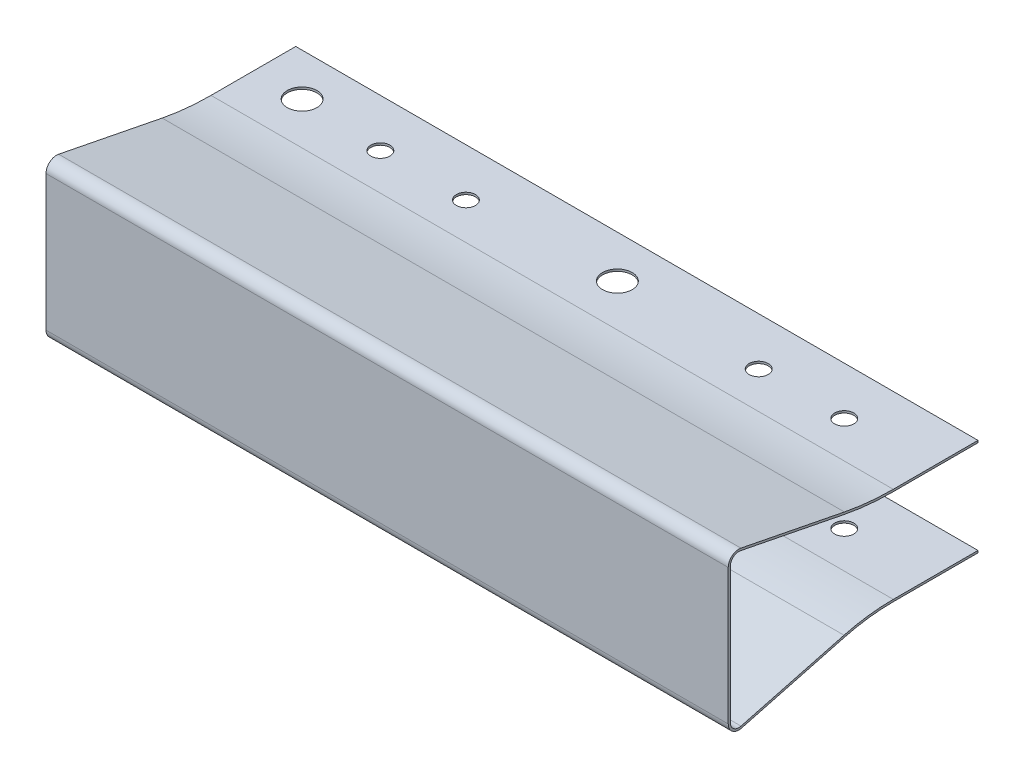
ISO-10303-21;
HEADER;
FILE_DESCRIPTION(('STEP AP214'),'2;1');
FILE_NAME('part.step','',(''),(''),'','','');
FILE_SCHEMA(('AUTOMOTIVE_DESIGN { 1 0 10303 214 1 1 1 1 }'));
ENDSEC;
DATA;
#1=APPLICATION_CONTEXT('core data for automotive mechanical design processes');
#2=APPLICATION_PROTOCOL_DEFINITION('international standard','automotive_design',2000,#1);
#3=PRODUCT_CONTEXT('',#1,'mechanical');
#4=PRODUCT('Part','Part','',(#3));
#5=PRODUCT_RELATED_PRODUCT_CATEGORY('part','',(#4));
#6=PRODUCT_DEFINITION_FORMATION('','',#4);
#7=PRODUCT_DEFINITION_CONTEXT('part definition',#1,'design');
#8=PRODUCT_DEFINITION('design','',#6,#7);
#9=PRODUCT_DEFINITION_SHAPE('','',#8);
#10=(LENGTH_UNIT() NAMED_UNIT(*) SI_UNIT(.MILLI.,.METRE.));
#11=(NAMED_UNIT(*) PLANE_ANGLE_UNIT() SI_UNIT($,.RADIAN.));
#12=(NAMED_UNIT(*) SI_UNIT($,.STERADIAN.) SOLID_ANGLE_UNIT());
#13=UNCERTAINTY_MEASURE_WITH_UNIT(LENGTH_MEASURE(1.E-05),#10,'distance_accuracy_value','');
#14=(GEOMETRIC_REPRESENTATION_CONTEXT(3) GLOBAL_UNCERTAINTY_ASSIGNED_CONTEXT((#13)) GLOBAL_UNIT_ASSIGNED_CONTEXT((#10,
#11,#12)) REPRESENTATION_CONTEXT('',''));
#15=CARTESIAN_POINT('',(0.,0.,0.));
#16=DIRECTION('',(0.,0.,1.));
#17=DIRECTION('',(1.,0.,0.));
#18=AXIS2_PLACEMENT_3D('',#15,#16,#17);
#19=CARTESIAN_POINT('',(40.25,8.,23.22));
#20=DIRECTION('',(-1.,0.,0.));
#21=DIRECTION('',(0.,0.,1.));
#22=AXIS2_PLACEMENT_3D('',#19,#20,#21);
#23=CYLINDRICAL_SURFACE('',#22,1.);
#24=CARTESIAN_POINT('',(-40.25,8.,23.22));
#25=DIRECTION('',(-1.,0.,0.));
#26=DIRECTION('',(0.,0.,-1.));
#27=AXIS2_PLACEMENT_3D('',#24,#25,#26);
#28=CIRCLE('',#27,1.);
#29=CARTESIAN_POINT('',(-40.25,8.,24.22));
#30=VERTEX_POINT('',#29);
#31=CARTESIAN_POINT('',(-40.25,8.98104394957776,23.0262146316233));
#32=VERTEX_POINT('',#31);
#33=EDGE_CURVE('E206',#30,#32,#28,.T.);
#34=ORIENTED_EDGE('',*,*,#33,.T.);
#35=DIRECTION('',(-1.,0.,0.));
#36=VECTOR('',#35,1.);
#37=CARTESIAN_POINT('',(40.25,8.98104394957776,23.0262146316233));
#38=LINE('',#37,#36);
#39=CARTESIAN_POINT('',(40.25,8.98104394957776,23.0262146316233));
#40=VERTEX_POINT('',#39);
#41=EDGE_CURVE('E11',#40,#32,#38,.T.);
#42=ORIENTED_EDGE('',*,*,#41,.F.);
#43=CARTESIAN_POINT('',(40.25,8.,23.22));
#44=DIRECTION('',(-1.,0.,0.));
#45=DIRECTION('',(0.,0.,-1.));
#46=AXIS2_PLACEMENT_3D('',#43,#44,#45);
#47=CIRCLE('',#46,1.);
#48=CARTESIAN_POINT('',(40.25,8.,24.22));
#49=VERTEX_POINT('',#48);
#50=EDGE_CURVE('E245',#49,#40,#47,.T.);
#51=ORIENTED_EDGE('',*,*,#50,.F.);
#52=DIRECTION('',(-1.,0.,0.));
#53=VECTOR('',#52,1.);
#54=CARTESIAN_POINT('',(40.25,8.,24.22));
#55=LINE('',#54,#53);
#56=EDGE_CURVE('E202',#49,#30,#55,.T.);
#57=ORIENTED_EDGE('',*,*,#56,.T.);
#58=EDGE_LOOP('',(#34,#42,#51,#57));
#59=FACE_BOUND('',#58,.T.);
#60=ADVANCED_FACE('F36',(#59),#23,.F.);
#61=CARTESIAN_POINT('',(40.25,6.56868151266737,10.8135610513));
#62=DIRECTION('',(0.,0.981043949577754,-0.193785368376667));
#63=DIRECTION('',(0.,0.193785368376667,0.981043949577755));
#64=AXIS2_PLACEMENT_3D('',#61,#62,#63);
#65=PLANE('',#64);
#66=DIRECTION('',(0.,-0.193785368376667,-0.981043949577754));
#67=VECTOR('',#66,1.);
#68=CARTESIAN_POINT('',(-40.25,6.56868151266737,10.8135610513));
#69=LINE('',#68,#67);
#70=CARTESIAN_POINT('',(-40.25,6.56868151266737,10.8135610513));
#71=VERTEX_POINT('',#70);
#72=EDGE_CURVE('E209',#32,#71,#69,.T.);
#73=ORIENTED_EDGE('',*,*,#72,.T.);
#74=DIRECTION('',(-1.,0.,0.));
#75=VECTOR('',#74,1.);
#76=CARTESIAN_POINT('',(40.25,6.56868151266737,10.8135610513));
#77=LINE('',#76,#75);
#78=CARTESIAN_POINT('',(40.25,6.56868151266737,10.8135610513));
#79=VERTEX_POINT('',#78);
#80=EDGE_CURVE('E45',#79,#71,#77,.T.);
#81=ORIENTED_EDGE('',*,*,#80,.F.);
#82=DIRECTION('',(0.,-0.193785368376667,-0.981043949577754));
#83=VECTOR('',#82,1.);
#84=CARTESIAN_POINT('',(40.25,6.56868151266737,10.8135610513));
#85=LINE('',#84,#83);
#86=EDGE_CURVE('E133',#40,#79,#85,.T.);
#87=ORIENTED_EDGE('',*,*,#86,.F.);
#88=ORIENTED_EDGE('',*,*,#41,.T.);
#89=EDGE_LOOP('',(#73,#81,#87,#88));
#90=FACE_BOUND('',#89,.T.);
#91=ADVANCED_FACE('F420',(#90),#65,.F.);
#92=CARTESIAN_POINT('',(40.25,36.,5.));
#93=DIRECTION('',(-1.,0.,0.));
#94=DIRECTION('',(0.,0.,1.));
#95=AXIS2_PLACEMENT_3D('',#92,#93,#94);
#96=CYLINDRICAL_SURFACE('',#95,30.);
#97=CARTESIAN_POINT('',(-40.25,36.,5.));
#98=DIRECTION('',(1.,0.,0.));
#99=DIRECTION('',(0.,0.,1.));
#100=AXIS2_PLACEMENT_3D('',#97,#98,#99);
#101=CIRCLE('',#100,30.);
#102=CARTESIAN_POINT('',(-40.25,6.,5.));
#103=VERTEX_POINT('',#102);
#104=EDGE_CURVE('E212',#71,#103,#101,.T.);
#105=ORIENTED_EDGE('',*,*,#104,.T.);
#106=DIRECTION('',(-1.,0.,0.));
#107=VECTOR('',#106,1.);
#108=CARTESIAN_POINT('',(40.25,6.,5.));
#109=LINE('',#108,#107);
#110=CARTESIAN_POINT('',(40.25,6.,5.));
#111=VERTEX_POINT('',#110);
#112=EDGE_CURVE('E288',#111,#103,#109,.T.);
#113=ORIENTED_EDGE('',*,*,#112,.F.);
#114=CARTESIAN_POINT('',(40.25,36.,5.));
#115=DIRECTION('',(1.,0.,0.));
#116=DIRECTION('',(0.,0.,1.));
#117=AXIS2_PLACEMENT_3D('',#114,#115,#116);
#118=CIRCLE('',#117,30.);
#119=EDGE_CURVE('E365',#79,#111,#118,.T.);
#120=ORIENTED_EDGE('',*,*,#119,.F.);
#121=ORIENTED_EDGE('',*,*,#80,.T.);
#122=EDGE_LOOP('',(#105,#113,#120,#121));
#123=FACE_BOUND('',#122,.T.);
#124=ADVANCED_FACE('F424',(#123),#96,.T.);
#125=CARTESIAN_POINT('',(40.25,6.,5.));
#126=DIRECTION('',(0.,1.,0.));
#127=DIRECTION('',(0.,0.,1.));
#128=AXIS2_PLACEMENT_3D('',#125,#126,#127);
#129=PLANE('',#128);
#130=CARTESIAN_POINT('',(30.12,6.,0.649999999999999));
#131=DIRECTION('',(0.,1.,0.));
#132=DIRECTION('',(0.,0.,1.));
#133=AXIS2_PLACEMENT_3D('',#130,#131,#132);
#134=CIRCLE('',#133,1.125);
#135=CARTESIAN_POINT('',(30.12,6.,1.775));
#136=VERTEX_POINT('',#135);
#137=EDGE_CURVE('E315',#136,#136,#134,.T.);
#138=ORIENTED_EDGE('',*,*,#137,.T.);
#139=EDGE_LOOP('',(#138));
#140=FACE_BOUND('',#139,.T.);
#141=CARTESIAN_POINT('',(20.02,6.,0.649999999999998));
#142=DIRECTION('',(0.,1.,0.));
#143=DIRECTION('',(0.,0.,1.));
#144=AXIS2_PLACEMENT_3D('',#141,#142,#143);
#145=CIRCLE('',#144,1.125);
#146=CARTESIAN_POINT('',(20.02,6.,1.775));
#147=VERTEX_POINT('',#146);
#148=EDGE_CURVE('E311',#147,#147,#145,.T.);
#149=ORIENTED_EDGE('',*,*,#148,.T.);
#150=EDGE_LOOP('',(#149));
#151=FACE_BOUND('',#150,.T.);
#152=CARTESIAN_POINT('',(2.69999999999999,6.,0.));
#153=DIRECTION('',(0.,1.,0.));
#154=DIRECTION('',(0.,0.,1.));
#155=AXIS2_PLACEMENT_3D('',#152,#153,#154);
#156=CIRCLE('',#155,1.75);
#157=CARTESIAN_POINT('',(2.69999999999999,6.,1.75));
#158=VERTEX_POINT('',#157);
#159=EDGE_CURVE('E307',#158,#158,#156,.T.);
#160=ORIENTED_EDGE('',*,*,#159,.T.);
#161=EDGE_LOOP('',(#160));
#162=FACE_BOUND('',#161,.T.);
#163=CARTESIAN_POINT('',(-14.52,6.,0.649999999999999));
#164=DIRECTION('',(0.,1.,0.));
#165=DIRECTION('',(0.,0.,1.));
#166=AXIS2_PLACEMENT_3D('',#163,#164,#165);
#167=CIRCLE('',#166,1.125);
#168=CARTESIAN_POINT('',(-14.52,6.,1.775));
#169=VERTEX_POINT('',#168);
#170=EDGE_CURVE('E302',#169,#169,#167,.T.);
#171=ORIENTED_EDGE('',*,*,#170,.T.);
#172=EDGE_LOOP('',(#171));
#173=FACE_BOUND('',#172,.T.);
#174=CARTESIAN_POINT('',(-24.62,6.,0.649999999999998));
#175=DIRECTION('',(0.,1.,0.));
#176=DIRECTION('',(0.,0.,1.));
#177=AXIS2_PLACEMENT_3D('',#174,#175,#176);
#178=CIRCLE('',#177,1.125);
#179=CARTESIAN_POINT('',(-24.62,6.,1.775));
#180=VERTEX_POINT('',#179);
#181=EDGE_CURVE('E297',#180,#180,#178,.T.);
#182=ORIENTED_EDGE('',*,*,#181,.T.);
#183=EDGE_LOOP('',(#182));
#184=FACE_BOUND('',#183,.T.);
#185=CARTESIAN_POINT('',(-34.5,6.,0.));
#186=DIRECTION('',(0.,1.,0.));
#187=DIRECTION('',(0.,0.,1.));
#188=AXIS2_PLACEMENT_3D('',#185,#186,#187);
#189=CIRCLE('',#188,1.75);
#190=CARTESIAN_POINT('',(-34.5,6.,1.75));
#191=VERTEX_POINT('',#190);
#192=EDGE_CURVE('E210',#191,#191,#189,.T.);
#193=ORIENTED_EDGE('',*,*,#192,.T.);
#194=EDGE_LOOP('',(#193));
#195=FACE_BOUND('',#194,.T.);
#196=DIRECTION('',(0.,0.,-1.));
#197=VECTOR('',#196,1.);
#198=CARTESIAN_POINT('',(-40.25,6.,5.));
#199=LINE('',#198,#197);
#200=CARTESIAN_POINT('',(-40.25,6.,-5.));
#201=VERTEX_POINT('',#200);
#202=EDGE_CURVE('E214',#103,#201,#199,.T.);
#203=ORIENTED_EDGE('',*,*,#202,.T.);
#204=DIRECTION('',(-1.,0.,0.));
#205=VECTOR('',#204,1.);
#206=CARTESIAN_POINT('',(40.25,6.,-5.));
#207=LINE('',#206,#205);
#208=CARTESIAN_POINT('',(40.25,6.,-5.));
#209=VERTEX_POINT('',#208);
#210=EDGE_CURVE('E285',#209,#201,#207,.T.);
#211=ORIENTED_EDGE('',*,*,#210,.F.);
#212=DIRECTION('',(0.,0.,-1.));
#213=VECTOR('',#212,1.);
#214=CARTESIAN_POINT('',(40.25,6.,5.));
#215=LINE('',#214,#213);
#216=EDGE_CURVE('E367',#111,#209,#215,.T.);
#217=ORIENTED_EDGE('',*,*,#216,.F.);
#218=ORIENTED_EDGE('',*,*,#112,.T.);
#219=EDGE_LOOP('',(#203,#211,#217,#218));
#220=FACE_BOUND('',#219,.T.);
#221=ADVANCED_FACE('F428',(#140,#151,#162,#173,#184,#195,#220),#129,.F.);
#222=CARTESIAN_POINT('',(40.25,6.25,-5.));
#223=DIRECTION('',(0.,0.,1.));
#224=DIRECTION('',(1.,0.,0.));
#225=AXIS2_PLACEMENT_3D('',#222,#223,#224);
#226=PLANE('',#225);
#227=DIRECTION('',(0.,1.,0.));
#228=VECTOR('',#227,1.);
#229=CARTESIAN_POINT('',(-40.25,6.25,-5.));
#230=LINE('',#229,#228);
#231=CARTESIAN_POINT('',(-40.25,6.25,-5.));
#232=VERTEX_POINT('',#231);
#233=EDGE_CURVE('E216',#201,#232,#230,.T.);
#234=ORIENTED_EDGE('',*,*,#233,.T.);
#235=DIRECTION('',(-1.,0.,0.));
#236=VECTOR('',#235,1.);
#237=CARTESIAN_POINT('',(40.25,6.25,-5.));
#238=LINE('',#237,#236);
#239=CARTESIAN_POINT('',(40.25,6.25,-5.));
#240=VERTEX_POINT('',#239);
#241=EDGE_CURVE('E282',#240,#232,#238,.T.);
#242=ORIENTED_EDGE('',*,*,#241,.F.);
#243=DIRECTION('',(0.,1.,0.));
#244=VECTOR('',#243,1.);
#245=CARTESIAN_POINT('',(40.25,6.25,-5.));
#246=LINE('',#245,#244);
#247=EDGE_CURVE('E369',#209,#240,#246,.T.);
#248=ORIENTED_EDGE('',*,*,#247,.F.);
#249=ORIENTED_EDGE('',*,*,#210,.T.);
#250=EDGE_LOOP('',(#234,#242,#248,#249));
#251=FACE_BOUND('',#250,.T.);
#252=ADVANCED_FACE('F434',(#251),#226,.F.);
#253=CARTESIAN_POINT('',(40.25,6.25,5.));
#254=DIRECTION('',(0.,-1.,0.));
#255=DIRECTION('',(0.,0.,-1.));
#256=AXIS2_PLACEMENT_3D('',#253,#254,#255);
#257=PLANE('',#256);
#258=CARTESIAN_POINT('',(30.12,6.25,0.649999999999999));
#259=DIRECTION('',(0.,-1.,0.));
#260=DIRECTION('',(0.,0.,-1.));
#261=AXIS2_PLACEMENT_3D('',#258,#259,#260);
#262=CIRCLE('',#261,1.125);
#263=CARTESIAN_POINT('',(30.12,6.25,-0.475000000000003));
#264=VERTEX_POINT('',#263);
#265=EDGE_CURVE('E322',#264,#264,#262,.T.);
#266=ORIENTED_EDGE('',*,*,#265,.T.);
#267=EDGE_LOOP('',(#266));
#268=FACE_BOUND('',#267,.T.);
#269=CARTESIAN_POINT('',(20.02,6.25,0.649999999999998));
#270=DIRECTION('',(0.,-1.,0.));
#271=DIRECTION('',(0.,0.,-1.));
#272=AXIS2_PLACEMENT_3D('',#269,#270,#271);
#273=CIRCLE('',#272,1.125);
#274=CARTESIAN_POINT('',(20.02,6.25,-0.475000000000003));
#275=VERTEX_POINT('',#274);
#276=EDGE_CURVE('E319',#275,#275,#273,.T.);
#277=ORIENTED_EDGE('',*,*,#276,.T.);
#278=EDGE_LOOP('',(#277));
#279=FACE_BOUND('',#278,.T.);
#280=CARTESIAN_POINT('',(2.69999999999999,6.25,0.));
#281=DIRECTION('',(0.,-1.,0.));
#282=DIRECTION('',(0.,0.,-1.));
#283=AXIS2_PLACEMENT_3D('',#280,#281,#282);
#284=CIRCLE('',#283,1.75);
#285=CARTESIAN_POINT('',(2.69999999999999,6.25,-1.75));
#286=VERTEX_POINT('',#285);
#287=EDGE_CURVE('E337',#286,#286,#284,.T.);
#288=ORIENTED_EDGE('',*,*,#287,.T.);
#289=EDGE_LOOP('',(#288));
#290=FACE_BOUND('',#289,.T.);
#291=CARTESIAN_POINT('',(-14.52,6.25,0.649999999999999));
#292=DIRECTION('',(0.,-1.,0.));
#293=DIRECTION('',(0.,0.,-1.));
#294=AXIS2_PLACEMENT_3D('',#291,#292,#293);
#295=CIRCLE('',#294,1.125);
#296=CARTESIAN_POINT('',(-14.52,6.25,-0.475000000000003));
#297=VERTEX_POINT('',#296);
#298=EDGE_CURVE('E344',#297,#297,#295,.T.);
#299=ORIENTED_EDGE('',*,*,#298,.T.);
#300=EDGE_LOOP('',(#299));
#301=FACE_BOUND('',#300,.T.);
#302=CARTESIAN_POINT('',(-24.62,6.25,0.649999999999998));
#303=DIRECTION('',(0.,-1.,0.));
#304=DIRECTION('',(0.,0.,-1.));
#305=AXIS2_PLACEMENT_3D('',#302,#303,#304);
#306=CIRCLE('',#305,1.125);
#307=CARTESIAN_POINT('',(-24.62,6.25,-0.475000000000003));
#308=VERTEX_POINT('',#307);
#309=EDGE_CURVE('E351',#308,#308,#306,.T.);
#310=ORIENTED_EDGE('',*,*,#309,.T.);
#311=EDGE_LOOP('',(#310));
#312=FACE_BOUND('',#311,.T.);
#313=CARTESIAN_POINT('',(-34.5,6.25,0.));
#314=DIRECTION('',(0.,-1.,0.));
#315=DIRECTION('',(0.,0.,-1.));
#316=AXIS2_PLACEMENT_3D('',#313,#314,#315);
#317=CIRCLE('',#316,1.75);
#318=CARTESIAN_POINT('',(-34.5,6.25,-1.75));
#319=VERTEX_POINT('',#318);
#320=EDGE_CURVE('E358',#319,#319,#317,.T.);
#321=ORIENTED_EDGE('',*,*,#320,.T.);
#322=EDGE_LOOP('',(#321));
#323=FACE_BOUND('',#322,.T.);
#324=DIRECTION('',(0.,0.,1.));
#325=VECTOR('',#324,1.);
#326=CARTESIAN_POINT('',(-40.25,6.25,5.));
#327=LINE('',#326,#325);
#328=CARTESIAN_POINT('',(-40.25,6.25,4.99999999999999));
#329=VERTEX_POINT('',#328);
#330=EDGE_CURVE('E218',#232,#329,#327,.T.);
#331=ORIENTED_EDGE('',*,*,#330,.T.);
#332=DIRECTION('',(-1.,0.,0.));
#333=VECTOR('',#332,1.);
#334=CARTESIAN_POINT('',(40.25,6.25,4.99999999999999));
#335=LINE('',#334,#333);
#336=CARTESIAN_POINT('',(40.25,6.25,4.99999999999999));
#337=VERTEX_POINT('',#336);
#338=EDGE_CURVE('E279',#337,#329,#335,.T.);
#339=ORIENTED_EDGE('',*,*,#338,.F.);
#340=DIRECTION('',(0.,0.,1.));
#341=VECTOR('',#340,1.);
#342=CARTESIAN_POINT('',(40.25,6.25,5.));
#343=LINE('',#342,#341);
#344=EDGE_CURVE('E371',#240,#337,#343,.T.);
#345=ORIENTED_EDGE('',*,*,#344,.F.);
#346=ORIENTED_EDGE('',*,*,#241,.T.);
#347=EDGE_LOOP('',(#331,#339,#345,#346));
#348=FACE_BOUND('',#347,.T.);
#349=ADVANCED_FACE('F437',(#268,#279,#290,#301,#312,#323,#348),#257,.F.);
#350=CARTESIAN_POINT('',(40.25,36.,5.));
#351=DIRECTION('',(-1.,0.,0.));
#352=DIRECTION('',(0.,0.,1.));
#353=AXIS2_PLACEMENT_3D('',#350,#351,#352);
#354=CYLINDRICAL_SURFACE('',#353,29.75);
#355=CARTESIAN_POINT('',(-40.25,36.,5.));
#356=DIRECTION('',(-1.,0.,0.));
#357=DIRECTION('',(0.,0.,1.));
#358=AXIS2_PLACEMENT_3D('',#355,#356,#357);
#359=CIRCLE('',#358,29.75);
#360=CARTESIAN_POINT('',(-40.25,6.81394250006181,10.7651147092058));
#361=VERTEX_POINT('',#360);
#362=EDGE_CURVE('E220',#329,#361,#359,.T.);
#363=ORIENTED_EDGE('',*,*,#362,.T.);
#364=DIRECTION('',(-1.,0.,0.));
#365=VECTOR('',#364,1.);
#366=CARTESIAN_POINT('',(40.25,6.81394250006181,10.7651147092058));
#367=LINE('',#366,#365);
#368=CARTESIAN_POINT('',(40.25,6.81394250006181,10.7651147092058));
#369=VERTEX_POINT('',#368);
#370=EDGE_CURVE('E276',#369,#361,#367,.T.);
#371=ORIENTED_EDGE('',*,*,#370,.F.);
#372=CARTESIAN_POINT('',(40.25,36.,5.));
#373=DIRECTION('',(-1.,0.,0.));
#374=DIRECTION('',(0.,0.,1.));
#375=AXIS2_PLACEMENT_3D('',#372,#373,#374);
#376=CIRCLE('',#375,29.75);
#377=EDGE_CURVE('E373',#337,#369,#376,.T.);
#378=ORIENTED_EDGE('',*,*,#377,.F.);
#379=ORIENTED_EDGE('',*,*,#338,.T.);
#380=EDGE_LOOP('',(#363,#371,#378,#379));
#381=FACE_BOUND('',#380,.T.);
#382=ADVANCED_FACE('F441',(#381),#354,.F.);
#383=CARTESIAN_POINT('',(40.25,6.81394250006181,10.7651147092058));
#384=DIRECTION('',(0.,-0.981043949577754,0.193785368376667));
#385=DIRECTION('',(0.,-0.193785368376668,-0.981043949577754));
#386=AXIS2_PLACEMENT_3D('',#383,#384,#385);
#387=PLANE('',#386);
#388=DIRECTION('',(0.,0.193785368376668,0.981043949577754));
#389=VECTOR('',#388,1.);
#390=CARTESIAN_POINT('',(-40.25,6.81394250006181,10.7651147092058));
#391=LINE('',#390,#389);
#392=CARTESIAN_POINT('',(-40.25,9.22630493697219,22.9777682895292));
#393=VERTEX_POINT('',#392);
#394=EDGE_CURVE('E222',#361,#393,#391,.T.);
#395=ORIENTED_EDGE('',*,*,#394,.T.);
#396=DIRECTION('',(-1.,0.,0.));
#397=VECTOR('',#396,1.);
#398=CARTESIAN_POINT('',(40.25,9.22630493697219,22.9777682895292));
#399=LINE('',#398,#397);
#400=CARTESIAN_POINT('',(40.25,9.22630493697219,22.9777682895292));
#401=VERTEX_POINT('',#400);
#402=EDGE_CURVE('E273',#401,#393,#399,.T.);
#403=ORIENTED_EDGE('',*,*,#402,.F.);
#404=DIRECTION('',(0.,0.193785368376668,0.981043949577754));
#405=VECTOR('',#404,1.);
#406=CARTESIAN_POINT('',(40.25,6.81394250006181,10.7651147092058));
#407=LINE('',#406,#405);
#408=EDGE_CURVE('E375',#369,#401,#407,.T.);
#409=ORIENTED_EDGE('',*,*,#408,.F.);
#410=ORIENTED_EDGE('',*,*,#370,.T.);
#411=EDGE_LOOP('',(#395,#403,#409,#410));
#412=FACE_BOUND('',#411,.T.);
#413=ADVANCED_FACE('F445',(#412),#387,.F.);
#414=CARTESIAN_POINT('',(40.25,8.,23.22));
#415=DIRECTION('',(-1.,0.,0.));
#416=DIRECTION('',(0.,0.,1.));
#417=AXIS2_PLACEMENT_3D('',#414,#415,#416);
#418=CYLINDRICAL_SURFACE('',#417,1.25);
#419=CARTESIAN_POINT('',(-40.25,8.,23.22));
#420=DIRECTION('',(1.,0.,0.));
#421=DIRECTION('',(0.,0.,-1.));
#422=AXIS2_PLACEMENT_3D('',#419,#420,#421);
#423=CIRCLE('',#422,1.25);
#424=CARTESIAN_POINT('',(-40.25,8.,24.47));
#425=VERTEX_POINT('',#424);
#426=EDGE_CURVE('E224',#393,#425,#423,.T.);
#427=ORIENTED_EDGE('',*,*,#426,.T.);
#428=DIRECTION('',(-1.,0.,0.));
#429=VECTOR('',#428,1.);
#430=CARTESIAN_POINT('',(40.25,8.,24.47));
#431=LINE('',#430,#429);
#432=CARTESIAN_POINT('',(40.25,8.,24.47));
#433=VERTEX_POINT('',#432);
#434=EDGE_CURVE('E270',#433,#425,#431,.T.);
#435=ORIENTED_EDGE('',*,*,#434,.F.);
#436=CARTESIAN_POINT('',(40.25,8.,23.22));
#437=DIRECTION('',(1.,0.,0.));
#438=DIRECTION('',(0.,0.,-1.));
#439=AXIS2_PLACEMENT_3D('',#436,#437,#438);
#440=CIRCLE('',#439,1.25);
#441=EDGE_CURVE('E377',#401,#433,#440,.T.);
#442=ORIENTED_EDGE('',*,*,#441,.F.);
#443=ORIENTED_EDGE('',*,*,#402,.T.);
#444=EDGE_LOOP('',(#427,#435,#442,#443));
#445=FACE_BOUND('',#444,.T.);
#446=ADVANCED_FACE('F449',(#445),#418,.T.);
#447=CARTESIAN_POINT('',(40.25,8.,24.47));
#448=DIRECTION('',(0.,0.,-1.));
#449=DIRECTION('',(-1.,0.,0.));
#450=AXIS2_PLACEMENT_3D('',#447,#448,#449);
#451=PLANE('',#450);
#452=DIRECTION('',(0.,-1.,0.));
#453=VECTOR('',#452,1.);
#454=CARTESIAN_POINT('',(-40.25,8.,24.47));
#455=LINE('',#454,#453);
#456=CARTESIAN_POINT('',(-40.25,-8.,24.47));
#457=VERTEX_POINT('',#456);
#458=EDGE_CURVE('E226',#425,#457,#455,.T.);
#459=ORIENTED_EDGE('',*,*,#458,.T.);
#460=DIRECTION('',(-1.,0.,0.));
#461=VECTOR('',#460,1.);
#462=CARTESIAN_POINT('',(40.25,-8.,24.47));
#463=LINE('',#462,#461);
#464=CARTESIAN_POINT('',(40.25,-8.,24.47));
#465=VERTEX_POINT('',#464);
#466=EDGE_CURVE('E267',#465,#457,#463,.T.);
#467=ORIENTED_EDGE('',*,*,#466,.F.);
#468=DIRECTION('',(0.,-1.,0.));
#469=VECTOR('',#468,1.);
#470=CARTESIAN_POINT('',(40.25,8.,24.47));
#471=LINE('',#470,#469);
#472=EDGE_CURVE('E379',#433,#465,#471,.T.);
#473=ORIENTED_EDGE('',*,*,#472,.F.);
#474=ORIENTED_EDGE('',*,*,#434,.T.);
#475=EDGE_LOOP('',(#459,#467,#473,#474));
#476=FACE_BOUND('',#475,.T.);
#477=ADVANCED_FACE('F453',(#476),#451,.F.);
#478=CARTESIAN_POINT('',(40.25,-8.,23.22));
#479=DIRECTION('',(-1.,0.,0.));
#480=DIRECTION('',(0.,0.,1.));
#481=AXIS2_PLACEMENT_3D('',#478,#479,#480);
#482=CYLINDRICAL_SURFACE('',#481,1.25);
#483=CARTESIAN_POINT('',(-40.25,-8.,23.22));
#484=DIRECTION('',(1.,0.,0.));
#485=DIRECTION('',(0.,0.,-1.));
#486=AXIS2_PLACEMENT_3D('',#483,#484,#485);
#487=CIRCLE('',#486,1.25);
#488=CARTESIAN_POINT('',(-40.25,-9.20850235944556,22.9005910971583));
#489=VERTEX_POINT('',#488);
#490=EDGE_CURVE('E228',#457,#489,#487,.T.);
#491=ORIENTED_EDGE('',*,*,#490,.T.);
#492=DIRECTION('',(-1.,0.,0.));
#493=VECTOR('',#492,1.);
#494=CARTESIAN_POINT('',(40.25,-9.20850235944556,22.9005910971583));
#495=LINE('',#494,#493);
#496=CARTESIAN_POINT('',(40.25,-9.20850235944556,22.9005910971583));
#497=VERTEX_POINT('',#496);
#498=EDGE_CURVE('E264',#497,#489,#495,.T.);
#499=ORIENTED_EDGE('',*,*,#498,.F.);
#500=CARTESIAN_POINT('',(40.25,-8.,23.22));
#501=DIRECTION('',(1.,0.,0.));
#502=DIRECTION('',(0.,0.,-1.));
#503=AXIS2_PLACEMENT_3D('',#500,#501,#502);
#504=CIRCLE('',#503,1.25);
#505=EDGE_CURVE('E381',#465,#497,#504,.T.);
#506=ORIENTED_EDGE('',*,*,#505,.F.);
#507=ORIENTED_EDGE('',*,*,#466,.T.);
#508=EDGE_LOOP('',(#491,#499,#506,#507));
#509=FACE_BOUND('',#508,.T.);
#510=ADVANCED_FACE('F457',(#509),#482,.T.);
#511=CARTESIAN_POINT('',(40.25,-5.99699897703984,10.7496792707317));
#512=DIRECTION('',(0.,0.966801887556448,0.25552712227333));
#513=DIRECTION('',(0.,-0.25552712227333,0.966801887556448));
#514=AXIS2_PLACEMENT_3D('',#511,#512,#513);
#515=PLANE('',#514);
#516=DIRECTION('',(0.,0.255527122273329,-0.966801887556448));
#517=VECTOR('',#516,1.);
#518=CARTESIAN_POINT('',(-40.25,-5.99699897703984,10.7496792707317));
#519=LINE('',#518,#517);
#520=CARTESIAN_POINT('',(-40.25,-5.99699897703983,10.7496792707317));
#521=VERTEX_POINT('',#520);
#522=EDGE_CURVE('E230',#489,#521,#519,.T.);
#523=ORIENTED_EDGE('',*,*,#522,.T.);
#524=DIRECTION('',(-1.,0.,0.));
#525=VECTOR('',#524,1.);
#526=CARTESIAN_POINT('',(40.25,-5.99699897703983,10.7496792707317));
#527=LINE('',#526,#525);
#528=CARTESIAN_POINT('',(40.25,-5.99699897703983,10.7496792707317));
#529=VERTEX_POINT('',#528);
#530=EDGE_CURVE('E261',#529,#521,#527,.T.);
#531=ORIENTED_EDGE('',*,*,#530,.F.);
#532=DIRECTION('',(0.,0.255527122273329,-0.966801887556448));
#533=VECTOR('',#532,1.);
#534=CARTESIAN_POINT('',(40.25,-5.99699897703984,10.7496792707317));
#535=LINE('',#534,#533);
#536=EDGE_CURVE('E383',#497,#529,#535,.T.);
#537=ORIENTED_EDGE('',*,*,#536,.F.);
#538=ORIENTED_EDGE('',*,*,#498,.T.);
#539=EDGE_LOOP('',(#523,#531,#537,#538));
#540=FACE_BOUND('',#539,.T.);
#541=ADVANCED_FACE('F461',(#540),#515,.F.);
#542=CARTESIAN_POINT('',(40.25,-27.7512484764001,5.));
#543=DIRECTION('',(-1.,0.,0.));
#544=DIRECTION('',(0.,0.,1.));
#545=AXIS2_PLACEMENT_3D('',#542,#543,#544);
#546=CYLINDRICAL_SURFACE('',#545,22.5012484764001);
#547=CARTESIAN_POINT('',(-40.25,-27.7512484764001,5.));
#548=DIRECTION('',(-1.,0.,0.));
#549=DIRECTION('',(0.,0.,-1.));
#550=AXIS2_PLACEMENT_3D('',#547,#548,#549);
#551=CIRCLE('',#550,22.5012484764001);
#552=CARTESIAN_POINT('',(-40.25,-5.25,5.));
#553=VERTEX_POINT('',#552);
#554=EDGE_CURVE('E232',#521,#553,#551,.T.);
#555=ORIENTED_EDGE('',*,*,#554,.T.);
#556=DIRECTION('',(-1.,0.,0.));
#557=VECTOR('',#556,1.);
#558=CARTESIAN_POINT('',(40.25,-5.25,5.));
#559=LINE('',#558,#557);
#560=CARTESIAN_POINT('',(40.25,-5.25,5.));
#561=VERTEX_POINT('',#560);
#562=EDGE_CURVE('E258',#561,#553,#559,.T.);
#563=ORIENTED_EDGE('',*,*,#562,.F.);
#564=CARTESIAN_POINT('',(40.25,-27.7512484764001,5.));
#565=DIRECTION('',(-1.,0.,0.));
#566=DIRECTION('',(0.,0.,-1.));
#567=AXIS2_PLACEMENT_3D('',#564,#565,#566);
#568=CIRCLE('',#567,22.5012484764001);
#569=EDGE_CURVE('E385',#529,#561,#568,.T.);
#570=ORIENTED_EDGE('',*,*,#569,.F.);
#571=ORIENTED_EDGE('',*,*,#530,.T.);
#572=EDGE_LOOP('',(#555,#563,#570,#571));
#573=FACE_BOUND('',#572,.T.);
#574=ADVANCED_FACE('F465',(#573),#546,.F.);
#575=CARTESIAN_POINT('',(40.25,-5.25,5.));
#576=DIRECTION('',(0.,1.,0.));
#577=DIRECTION('',(0.,0.,1.));
#578=AXIS2_PLACEMENT_3D('',#575,#576,#577);
#579=PLANE('',#578);
#580=CARTESIAN_POINT('',(30.12,-5.25,0.649999999999999));
#581=DIRECTION('',(0.,1.,0.));
#582=DIRECTION('',(0.,0.,1.));
#583=AXIS2_PLACEMENT_3D('',#580,#581,#582);
#584=CIRCLE('',#583,1.125);
#585=CARTESIAN_POINT('',(30.12,-5.25,1.775));
#586=VERTEX_POINT('',#585);
#587=EDGE_CURVE('E327',#586,#586,#584,.T.);
#588=ORIENTED_EDGE('',*,*,#587,.T.);
#589=EDGE_LOOP('',(#588));
#590=FACE_BOUND('',#589,.T.);
#591=CARTESIAN_POINT('',(20.02,-5.25,0.649999999999998));
#592=DIRECTION('',(0.,1.,0.));
#593=DIRECTION('',(0.,0.,1.));
#594=AXIS2_PLACEMENT_3D('',#591,#592,#593);
#595=CIRCLE('',#594,1.125);
#596=CARTESIAN_POINT('',(20.02,-5.25,1.775));
#597=VERTEX_POINT('',#596);
#598=EDGE_CURVE('E314',#597,#597,#595,.T.);
#599=ORIENTED_EDGE('',*,*,#598,.T.);
#600=EDGE_LOOP('',(#599));
#601=FACE_BOUND('',#600,.T.);
#602=CARTESIAN_POINT('',(2.69999999999999,-5.25,0.));
#603=DIRECTION('',(0.,1.,0.));
#604=DIRECTION('',(0.,0.,1.));
#605=AXIS2_PLACEMENT_3D('',#602,#603,#604);
#606=CIRCLE('',#605,1.75);
#607=CARTESIAN_POINT('',(2.69999999999999,-5.25,1.75));
#608=VERTEX_POINT('',#607);
#609=EDGE_CURVE('E310',#608,#608,#606,.T.);
#610=ORIENTED_EDGE('',*,*,#609,.T.);
#611=EDGE_LOOP('',(#610));
#612=FACE_BOUND('',#611,.T.);
#613=CARTESIAN_POINT('',(-14.52,-5.25,0.649999999999999));
#614=DIRECTION('',(0.,1.,0.));
#615=DIRECTION('',(0.,0.,1.));
#616=AXIS2_PLACEMENT_3D('',#613,#614,#615);
#617=CIRCLE('',#616,1.125);
#618=CARTESIAN_POINT('',(-14.52,-5.25,1.775));
#619=VERTEX_POINT('',#618);
#620=EDGE_CURVE('E306',#619,#619,#617,.T.);
#621=ORIENTED_EDGE('',*,*,#620,.T.);
#622=EDGE_LOOP('',(#621));
#623=FACE_BOUND('',#622,.T.);
#624=CARTESIAN_POINT('',(-24.62,-5.25,0.649999999999998));
#625=DIRECTION('',(0.,1.,0.));
#626=DIRECTION('',(0.,0.,1.));
#627=AXIS2_PLACEMENT_3D('',#624,#625,#626);
#628=CIRCLE('',#627,1.125);
#629=CARTESIAN_POINT('',(-24.62,-5.25,1.775));
#630=VERTEX_POINT('',#629);
#631=EDGE_CURVE('E301',#630,#630,#628,.T.);
#632=ORIENTED_EDGE('',*,*,#631,.T.);
#633=EDGE_LOOP('',(#632));
#634=FACE_BOUND('',#633,.T.);
#635=CARTESIAN_POINT('',(-34.5,-5.25,0.));
#636=DIRECTION('',(0.,1.,0.));
#637=DIRECTION('',(0.,0.,1.));
#638=AXIS2_PLACEMENT_3D('',#635,#636,#637);
#639=CIRCLE('',#638,1.75);
#640=CARTESIAN_POINT('',(-34.5,-5.25,1.75));
#641=VERTEX_POINT('',#640);
#642=EDGE_CURVE('E296',#641,#641,#639,.T.);
#643=ORIENTED_EDGE('',*,*,#642,.T.);
#644=EDGE_LOOP('',(#643));
#645=FACE_BOUND('',#644,.T.);
#646=DIRECTION('',(0.,0.,-1.));
#647=VECTOR('',#646,1.);
#648=CARTESIAN_POINT('',(-40.25,-5.25,5.));
#649=LINE('',#648,#647);
#650=CARTESIAN_POINT('',(-40.25,-5.25,-5.));
#651=VERTEX_POINT('',#650);
#652=EDGE_CURVE('E234',#553,#651,#649,.T.);
#653=ORIENTED_EDGE('',*,*,#652,.T.);
#654=DIRECTION('',(-1.,0.,0.));
#655=VECTOR('',#654,1.);
#656=CARTESIAN_POINT('',(40.25,-5.25,-5.));
#657=LINE('',#656,#655);
#658=CARTESIAN_POINT('',(40.25,-5.25,-5.));
#659=VERTEX_POINT('',#658);
#660=EDGE_CURVE('E255',#659,#651,#657,.T.);
#661=ORIENTED_EDGE('',*,*,#660,.F.);
#662=DIRECTION('',(0.,0.,-1.));
#663=VECTOR('',#662,1.);
#664=CARTESIAN_POINT('',(40.25,-5.25,5.));
#665=LINE('',#664,#663);
#666=EDGE_CURVE('E387',#561,#659,#665,.T.);
#667=ORIENTED_EDGE('',*,*,#666,.F.);
#668=ORIENTED_EDGE('',*,*,#562,.T.);
#669=EDGE_LOOP('',(#653,#661,#667,#668));
#670=FACE_BOUND('',#669,.T.);
#671=ADVANCED_FACE('F469',(#590,#601,#612,#623,#634,#645,#670),#579,.F.);
#672=CARTESIAN_POINT('',(40.25,-5.,-5.));
#673=DIRECTION('',(0.,0.,1.));
#674=DIRECTION('',(1.,0.,0.));
#675=AXIS2_PLACEMENT_3D('',#672,#673,#674);
#676=PLANE('',#675);
#677=DIRECTION('',(0.,1.,0.));
#678=VECTOR('',#677,1.);
#679=CARTESIAN_POINT('',(-40.25,-5.,-5.));
#680=LINE('',#679,#678);
#681=CARTESIAN_POINT('',(-40.25,-5.,-5.));
#682=VERTEX_POINT('',#681);
#683=EDGE_CURVE('E236',#651,#682,#680,.T.);
#684=ORIENTED_EDGE('',*,*,#683,.T.);
#685=DIRECTION('',(-1.,0.,0.));
#686=VECTOR('',#685,1.);
#687=CARTESIAN_POINT('',(40.25,-5.,-5.));
#688=LINE('',#687,#686);
#689=CARTESIAN_POINT('',(40.25,-5.,-5.));
#690=VERTEX_POINT('',#689);
#691=EDGE_CURVE('E252',#690,#682,#688,.T.);
#692=ORIENTED_EDGE('',*,*,#691,.F.);
#693=DIRECTION('',(0.,1.,0.));
#694=VECTOR('',#693,1.);
#695=CARTESIAN_POINT('',(40.25,-5.,-5.));
#696=LINE('',#695,#694);
#697=EDGE_CURVE('E389',#659,#690,#696,.T.);
#698=ORIENTED_EDGE('',*,*,#697,.F.);
#699=ORIENTED_EDGE('',*,*,#660,.T.);
#700=EDGE_LOOP('',(#684,#692,#698,#699));
#701=FACE_BOUND('',#700,.T.);
#702=ADVANCED_FACE('F473',(#701),#676,.F.);
#703=CARTESIAN_POINT('',(40.25,-5.,5.));
#704=DIRECTION('',(0.,-1.,0.));
#705=DIRECTION('',(0.,0.,-1.));
#706=AXIS2_PLACEMENT_3D('',#703,#704,#705);
#707=PLANE('',#706);
#708=CARTESIAN_POINT('',(30.12,-5.,0.649999999999999));
#709=DIRECTION('',(0.,-1.,0.));
#710=DIRECTION('',(0.,0.,-1.));
#711=AXIS2_PLACEMENT_3D('',#708,#709,#710);
#712=CIRCLE('',#711,1.125);
#713=CARTESIAN_POINT('',(30.12,-5.,-0.475000000000003));
#714=VERTEX_POINT('',#713);
#715=EDGE_CURVE('E39',#714,#714,#712,.T.);
#716=ORIENTED_EDGE('',*,*,#715,.T.);
#717=EDGE_LOOP('',(#716));
#718=FACE_BOUND('',#717,.T.);
#719=CARTESIAN_POINT('',(20.02,-5.,0.649999999999998));
#720=DIRECTION('',(0.,-1.,0.));
#721=DIRECTION('',(0.,0.,-1.));
#722=AXIS2_PLACEMENT_3D('',#719,#720,#721);
#723=CIRCLE('',#722,1.125);
#724=CARTESIAN_POINT('',(20.02,-5.,-0.475000000000003));
#725=VERTEX_POINT('',#724);
#726=EDGE_CURVE('E312',#725,#725,#723,.T.);
#727=ORIENTED_EDGE('',*,*,#726,.T.);
#728=EDGE_LOOP('',(#727));
#729=FACE_BOUND('',#728,.T.);
#730=CARTESIAN_POINT('',(2.69999999999999,-5.,0.));
#731=DIRECTION('',(0.,-1.,0.));
#732=DIRECTION('',(0.,0.,-1.));
#733=AXIS2_PLACEMENT_3D('',#730,#731,#732);
#734=CIRCLE('',#733,1.75);
#735=CARTESIAN_POINT('',(2.69999999999999,-5.,-1.75));
#736=VERTEX_POINT('',#735);
#737=EDGE_CURVE('E308',#736,#736,#734,.T.);
#738=ORIENTED_EDGE('',*,*,#737,.T.);
#739=EDGE_LOOP('',(#738));
#740=FACE_BOUND('',#739,.T.);
#741=CARTESIAN_POINT('',(-14.52,-5.,0.649999999999999));
#742=DIRECTION('',(0.,-1.,0.));
#743=DIRECTION('',(0.,0.,-1.));
#744=AXIS2_PLACEMENT_3D('',#741,#742,#743);
#745=CIRCLE('',#744,1.125);
#746=CARTESIAN_POINT('',(-14.52,-5.,-0.475000000000003));
#747=VERTEX_POINT('',#746);
#748=EDGE_CURVE('E303',#747,#747,#745,.T.);
#749=ORIENTED_EDGE('',*,*,#748,.T.);
#750=EDGE_LOOP('',(#749));
#751=FACE_BOUND('',#750,.T.);
#752=CARTESIAN_POINT('',(-24.62,-5.,0.649999999999998));
#753=DIRECTION('',(0.,-1.,0.));
#754=DIRECTION('',(0.,0.,-1.));
#755=AXIS2_PLACEMENT_3D('',#752,#753,#754);
#756=CIRCLE('',#755,1.125);
#757=CARTESIAN_POINT('',(-24.62,-5.,-0.475000000000003));
#758=VERTEX_POINT('',#757);
#759=EDGE_CURVE('E298',#758,#758,#756,.T.);
#760=ORIENTED_EDGE('',*,*,#759,.T.);
#761=EDGE_LOOP('',(#760));
#762=FACE_BOUND('',#761,.T.);
#763=CARTESIAN_POINT('',(-34.5,-5.,0.));
#764=DIRECTION('',(0.,-1.,0.));
#765=DIRECTION('',(0.,0.,-1.));
#766=AXIS2_PLACEMENT_3D('',#763,#764,#765);
#767=CIRCLE('',#766,1.75);
#768=CARTESIAN_POINT('',(-34.5,-5.,-1.75));
#769=VERTEX_POINT('',#768);
#770=EDGE_CURVE('E293',#769,#769,#767,.T.);
#771=ORIENTED_EDGE('',*,*,#770,.T.);
#772=EDGE_LOOP('',(#771));
#773=FACE_BOUND('',#772,.T.);
#774=DIRECTION('',(0.,0.,1.));
#775=VECTOR('',#774,1.);
#776=CARTESIAN_POINT('',(-40.25,-5.,5.));
#777=LINE('',#776,#775);
#778=CARTESIAN_POINT('',(-40.25,-5.,5.));
#779=VERTEX_POINT('',#778);
#780=EDGE_CURVE('E238',#682,#779,#777,.T.);
#781=ORIENTED_EDGE('',*,*,#780,.T.);
#782=DIRECTION('',(-1.,0.,0.));
#783=VECTOR('',#782,1.);
#784=CARTESIAN_POINT('',(40.25,-5.,5.));
#785=LINE('',#784,#783);
#786=CARTESIAN_POINT('',(40.25,-5.,5.));
#787=VERTEX_POINT('',#786);
#788=EDGE_CURVE('E249',#787,#779,#785,.T.);
#789=ORIENTED_EDGE('',*,*,#788,.F.);
#790=DIRECTION('',(0.,0.,1.));
#791=VECTOR('',#790,1.);
#792=CARTESIAN_POINT('',(40.25,-5.,5.));
#793=LINE('',#792,#791);
#794=EDGE_CURVE('E391',#690,#787,#793,.T.);
#795=ORIENTED_EDGE('',*,*,#794,.F.);
#796=ORIENTED_EDGE('',*,*,#691,.T.);
#797=EDGE_LOOP('',(#781,#789,#795,#796));
#798=FACE_BOUND('',#797,.T.);
#799=ADVANCED_FACE('F397',(#718,#729,#740,#751,#762,#773,#798),#707,.F.);
#800=CARTESIAN_POINT('',(40.25,-27.7512484764001,5.));
#801=DIRECTION('',(-1.,0.,0.));
#802=DIRECTION('',(0.,0.,1.));
#803=AXIS2_PLACEMENT_3D('',#800,#801,#802);
#804=CYLINDRICAL_SURFACE('',#803,22.7512484764001);
#805=CARTESIAN_POINT('',(-40.25,-27.7512484764001,5.));
#806=DIRECTION('',(1.,0.,0.));
#807=DIRECTION('',(0.,0.,-1.));
#808=AXIS2_PLACEMENT_3D('',#805,#806,#807);
#809=CIRCLE('',#808,22.7512484764001);
#810=CARTESIAN_POINT('',(-40.25,-5.75529850515072,10.8135610513));
#811=VERTEX_POINT('',#810);
#812=EDGE_CURVE('E240',#779,#811,#809,.T.);
#813=ORIENTED_EDGE('',*,*,#812,.T.);
#814=DIRECTION('',(-1.,0.,0.));
#815=VECTOR('',#814,1.);
#816=CARTESIAN_POINT('',(40.25,-5.75529850515072,10.8135610513));
#817=LINE('',#816,#815);
#818=CARTESIAN_POINT('',(40.25,-5.75529850515072,10.8135610513));
#819=VERTEX_POINT('',#818);
#820=EDGE_CURVE('E197',#819,#811,#817,.T.);
#821=ORIENTED_EDGE('',*,*,#820,.F.);
#822=CARTESIAN_POINT('',(40.25,-27.7512484764001,5.));
#823=DIRECTION('',(1.,0.,0.));
#824=DIRECTION('',(0.,0.,-1.));
#825=AXIS2_PLACEMENT_3D('',#822,#823,#824);
#826=CIRCLE('',#825,22.7512484764001);
#827=EDGE_CURVE('E188',#787,#819,#826,.T.);
#828=ORIENTED_EDGE('',*,*,#827,.F.);
#829=ORIENTED_EDGE('',*,*,#788,.T.);
#830=EDGE_LOOP('',(#813,#821,#828,#829));
#831=FACE_BOUND('',#830,.T.);
#832=ADVANCED_FACE('F401',(#831),#804,.T.);
#833=CARTESIAN_POINT('',(40.25,-5.75529850515072,10.8135610513));
#834=DIRECTION('',(0.,-0.966801887556448,-0.25552712227333));
#835=DIRECTION('',(0.,0.25552712227333,-0.966801887556448));
#836=AXIS2_PLACEMENT_3D('',#833,#834,#835);
#837=PLANE('',#836);
#838=DIRECTION('',(0.,-0.25552712227333,0.966801887556448));
#839=VECTOR('',#838,1.);
#840=CARTESIAN_POINT('',(-40.25,-5.75529850515072,10.8135610513));
#841=LINE('',#840,#839);
#842=CARTESIAN_POINT('',(-40.25,-8.96680188755645,22.9644728777267));
#843=VERTEX_POINT('',#842);
#844=EDGE_CURVE('E196',#811,#843,#841,.T.);
#845=ORIENTED_EDGE('',*,*,#844,.T.);
#846=DIRECTION('',(-1.,0.,0.));
#847=VECTOR('',#846,1.);
#848=CARTESIAN_POINT('',(40.25,-8.96680188755645,22.9644728777267));
#849=LINE('',#848,#847);
#850=CARTESIAN_POINT('',(40.25,-8.96680188755645,22.9644728777267));
#851=VERTEX_POINT('',#850);
#852=EDGE_CURVE('E193',#851,#843,#849,.T.);
#853=ORIENTED_EDGE('',*,*,#852,.F.);
#854=DIRECTION('',(0.,-0.25552712227333,0.966801887556448));
#855=VECTOR('',#854,1.);
#856=CARTESIAN_POINT('',(40.25,-5.75529850515072,10.8135610513));
#857=LINE('',#856,#855);
#858=EDGE_CURVE('E182',#819,#851,#857,.T.);
#859=ORIENTED_EDGE('',*,*,#858,.F.);
#860=ORIENTED_EDGE('',*,*,#820,.T.);
#861=EDGE_LOOP('',(#845,#853,#859,#860));
#862=FACE_BOUND('',#861,.T.);
#863=ADVANCED_FACE('F194',(#862),#837,.F.);
#864=CARTESIAN_POINT('',(40.25,-8.,23.22));
#865=DIRECTION('',(-1.,0.,0.));
#866=DIRECTION('',(0.,0.,1.));
#867=AXIS2_PLACEMENT_3D('',#864,#865,#866);
#868=CYLINDRICAL_SURFACE('',#867,1.);
#869=CARTESIAN_POINT('',(-40.25,-8.,23.22));
#870=DIRECTION('',(-1.,0.,0.));
#871=DIRECTION('',(0.,0.,-1.));
#872=AXIS2_PLACEMENT_3D('',#869,#870,#871);
#873=CIRCLE('',#872,1.);
#874=CARTESIAN_POINT('',(-40.25,-8.,24.22));
#875=VERTEX_POINT('',#874);
#876=EDGE_CURVE('E119',#843,#875,#873,.T.);
#877=ORIENTED_EDGE('',*,*,#876,.T.);
#878=DIRECTION('',(-1.,0.,0.));
#879=VECTOR('',#878,1.);
#880=CARTESIAN_POINT('',(40.25,-8.,24.22));
#881=LINE('',#880,#879);
#882=CARTESIAN_POINT('',(40.25,-8.,24.22));
#883=VERTEX_POINT('',#882);
#884=EDGE_CURVE('E198',#883,#875,#881,.T.);
#885=ORIENTED_EDGE('',*,*,#884,.F.);
#886=CARTESIAN_POINT('',(40.25,-8.,23.22));
#887=DIRECTION('',(-1.,0.,0.));
#888=DIRECTION('',(0.,0.,-1.));
#889=AXIS2_PLACEMENT_3D('',#886,#887,#888);
#890=CIRCLE('',#889,1.);
#891=EDGE_CURVE('E186',#851,#883,#890,.T.);
#892=ORIENTED_EDGE('',*,*,#891,.F.);
#893=ORIENTED_EDGE('',*,*,#852,.T.);
#894=EDGE_LOOP('',(#877,#885,#892,#893));
#895=FACE_BOUND('',#894,.T.);
#896=ADVANCED_FACE('F200',(#895),#868,.F.);
#897=CARTESIAN_POINT('',(40.25,8.,24.22));
#898=DIRECTION('',(0.,0.,1.));
#899=DIRECTION('',(1.,0.,0.));
#900=AXIS2_PLACEMENT_3D('',#897,#898,#899);
#901=PLANE('',#900);
#902=DIRECTION('',(0.,1.,0.));
#903=VECTOR('',#902,1.);
#904=CARTESIAN_POINT('',(-40.25,8.,24.22));
#905=LINE('',#904,#903);
#906=EDGE_CURVE('E125',#875,#30,#905,.T.);
#907=ORIENTED_EDGE('',*,*,#906,.T.);
#908=ORIENTED_EDGE('',*,*,#56,.F.);
#909=DIRECTION('',(0.,1.,0.));
#910=VECTOR('',#909,1.);
#911=CARTESIAN_POINT('',(40.25,8.,24.22));
#912=LINE('',#911,#910);
#913=EDGE_CURVE('E54',#883,#49,#912,.T.);
#914=ORIENTED_EDGE('',*,*,#913,.F.);
#915=ORIENTED_EDGE('',*,*,#884,.T.);
#916=EDGE_LOOP('',(#907,#908,#914,#915));
#917=FACE_BOUND('',#916,.T.);
#918=ADVANCED_FACE('F409',(#917),#901,.F.);
#919=CARTESIAN_POINT('',(40.25,8.,23.22));
#920=DIRECTION('',(1.,0.,0.));
#921=DIRECTION('',(0.,0.,-1.));
#922=AXIS2_PLACEMENT_3D('',#919,#920,#921);
#923=PLANE('',#922);
#924=ORIENTED_EDGE('',*,*,#50,.T.);
#925=ORIENTED_EDGE('',*,*,#86,.T.);
#926=ORIENTED_EDGE('',*,*,#119,.T.);
#927=ORIENTED_EDGE('',*,*,#216,.T.);
#928=ORIENTED_EDGE('',*,*,#247,.T.);
#929=ORIENTED_EDGE('',*,*,#344,.T.);
#930=ORIENTED_EDGE('',*,*,#377,.T.);
#931=ORIENTED_EDGE('',*,*,#408,.T.);
#932=ORIENTED_EDGE('',*,*,#441,.T.);
#933=ORIENTED_EDGE('',*,*,#472,.T.);
#934=ORIENTED_EDGE('',*,*,#505,.T.);
#935=ORIENTED_EDGE('',*,*,#536,.T.);
#936=ORIENTED_EDGE('',*,*,#569,.T.);
#937=ORIENTED_EDGE('',*,*,#666,.T.);
#938=ORIENTED_EDGE('',*,*,#697,.T.);
#939=ORIENTED_EDGE('',*,*,#794,.T.);
#940=ORIENTED_EDGE('',*,*,#827,.T.);
#941=ORIENTED_EDGE('',*,*,#858,.T.);
#942=ORIENTED_EDGE('',*,*,#891,.T.);
#943=ORIENTED_EDGE('',*,*,#913,.T.);
#944=EDGE_LOOP('',(#924,#925,#926,#927,#928,#929,#930,#931,#932,#933,#934,#935,#936,#937,#938,
#939,#940,#941,#942,#943));
#945=FACE_BOUND('',#944,.T.);
#946=ADVANCED_FACE('F184',(#945),#923,.T.);
#947=CARTESIAN_POINT('',(-40.25,8.,23.22));
#948=DIRECTION('',(1.,0.,0.));
#949=DIRECTION('',(0.,0.,-1.));
#950=AXIS2_PLACEMENT_3D('',#947,#948,#949);
#951=PLANE('',#950);
#952=ORIENTED_EDGE('',*,*,#33,.F.);
#953=ORIENTED_EDGE('',*,*,#906,.F.);
#954=ORIENTED_EDGE('',*,*,#876,.F.);
#955=ORIENTED_EDGE('',*,*,#844,.F.);
#956=ORIENTED_EDGE('',*,*,#812,.F.);
#957=ORIENTED_EDGE('',*,*,#780,.F.);
#958=ORIENTED_EDGE('',*,*,#683,.F.);
#959=ORIENTED_EDGE('',*,*,#652,.F.);
#960=ORIENTED_EDGE('',*,*,#554,.F.);
#961=ORIENTED_EDGE('',*,*,#522,.F.);
#962=ORIENTED_EDGE('',*,*,#490,.F.);
#963=ORIENTED_EDGE('',*,*,#458,.F.);
#964=ORIENTED_EDGE('',*,*,#426,.F.);
#965=ORIENTED_EDGE('',*,*,#394,.F.);
#966=ORIENTED_EDGE('',*,*,#362,.F.);
#967=ORIENTED_EDGE('',*,*,#330,.F.);
#968=ORIENTED_EDGE('',*,*,#233,.F.);
#969=ORIENTED_EDGE('',*,*,#202,.F.);
#970=ORIENTED_EDGE('',*,*,#104,.F.);
#971=ORIENTED_EDGE('',*,*,#72,.F.);
#972=EDGE_LOOP('',(#952,#953,#954,#955,#956,#957,#958,#959,#960,#961,#962,#963,#964,#965,#966,
#967,#968,#969,#970,#971));
#973=FACE_BOUND('',#972,.T.);
#974=ADVANCED_FACE('F404',(#973),#951,.F.);
#975=CARTESIAN_POINT('',(-34.5,-9.25,0.));
#976=DIRECTION('',(0.,1.,0.));
#977=DIRECTION('',(0.,0.,1.));
#978=AXIS2_PLACEMENT_3D('',#975,#976,#977);
#979=CYLINDRICAL_SURFACE('',#978,1.75);
#980=ORIENTED_EDGE('',*,*,#770,.F.);
#981=EDGE_LOOP('',(#980));
#982=FACE_BOUND('',#981,.T.);
#983=ORIENTED_EDGE('',*,*,#642,.F.);
#984=EDGE_LOOP('',(#983));
#985=FACE_BOUND('',#984,.T.);
#986=ADVANCED_FACE('F511',(#982,#985),#979,.F.);
#987=ORIENTED_EDGE('',*,*,#320,.F.);
#988=EDGE_LOOP('',(#987));
#989=FACE_BOUND('',#988,.T.);
#990=ORIENTED_EDGE('',*,*,#192,.F.);
#991=EDGE_LOOP('',(#990));
#992=FACE_BOUND('',#991,.T.);
#993=ADVANCED_FACE('F549',(#989,#992),#979,.F.);
#994=CARTESIAN_POINT('',(-24.62,-9.25,0.649999999999998));
#995=DIRECTION('',(0.,1.,0.));
#996=DIRECTION('',(0.,0.,1.));
#997=AXIS2_PLACEMENT_3D('',#994,#995,#996);
#998=CYLINDRICAL_SURFACE('',#997,1.125);
#999=ORIENTED_EDGE('',*,*,#759,.F.);
#1000=EDGE_LOOP('',(#999));
#1001=FACE_BOUND('',#1000,.T.);
#1002=ORIENTED_EDGE('',*,*,#631,.F.);
#1003=EDGE_LOOP('',(#1002));
#1004=FACE_BOUND('',#1003,.T.);
#1005=ADVANCED_FACE('F559',(#1001,#1004),#998,.F.);
#1006=ORIENTED_EDGE('',*,*,#309,.F.);
#1007=EDGE_LOOP('',(#1006));
#1008=FACE_BOUND('',#1007,.T.);
#1009=ORIENTED_EDGE('',*,*,#181,.F.);
#1010=EDGE_LOOP('',(#1009));
#1011=FACE_BOUND('',#1010,.T.);
#1012=ADVANCED_FACE('F568',(#1008,#1011),#998,.F.);
#1013=CARTESIAN_POINT('',(-14.52,-9.25,0.649999999999999));
#1014=DIRECTION('',(0.,1.,0.));
#1015=DIRECTION('',(0.,0.,1.));
#1016=AXIS2_PLACEMENT_3D('',#1013,#1014,#1015);
#1017=CYLINDRICAL_SURFACE('',#1016,1.125);
#1018=ORIENTED_EDGE('',*,*,#748,.F.);
#1019=EDGE_LOOP('',(#1018));
#1020=FACE_BOUND('',#1019,.T.);
#1021=ORIENTED_EDGE('',*,*,#620,.F.);
#1022=EDGE_LOOP('',(#1021));
#1023=FACE_BOUND('',#1022,.T.);
#1024=ADVANCED_FACE('F578',(#1020,#1023),#1017,.F.);
#1025=ORIENTED_EDGE('',*,*,#298,.F.);
#1026=EDGE_LOOP('',(#1025));
#1027=FACE_BOUND('',#1026,.T.);
#1028=ORIENTED_EDGE('',*,*,#170,.F.);
#1029=EDGE_LOOP('',(#1028));
#1030=FACE_BOUND('',#1029,.T.);
#1031=ADVANCED_FACE('F587',(#1027,#1030),#1017,.F.);
#1032=CARTESIAN_POINT('',(2.69999999999999,-9.25,0.));
#1033=DIRECTION('',(0.,1.,0.));
#1034=DIRECTION('',(0.,0.,1.));
#1035=AXIS2_PLACEMENT_3D('',#1032,#1033,#1034);
#1036=CYLINDRICAL_SURFACE('',#1035,1.75);
#1037=ORIENTED_EDGE('',*,*,#737,.F.);
#1038=EDGE_LOOP('',(#1037));
#1039=FACE_BOUND('',#1038,.T.);
#1040=ORIENTED_EDGE('',*,*,#609,.F.);
#1041=EDGE_LOOP('',(#1040));
#1042=FACE_BOUND('',#1041,.T.);
#1043=ADVANCED_FACE('F597',(#1039,#1042),#1036,.F.);
#1044=ORIENTED_EDGE('',*,*,#287,.F.);
#1045=EDGE_LOOP('',(#1044));
#1046=FACE_BOUND('',#1045,.T.);
#1047=ORIENTED_EDGE('',*,*,#159,.F.);
#1048=EDGE_LOOP('',(#1047));
#1049=FACE_BOUND('',#1048,.T.);
#1050=ADVANCED_FACE('F606',(#1046,#1049),#1036,.F.);
#1051=CARTESIAN_POINT('',(20.02,-9.25,0.649999999999998));
#1052=DIRECTION('',(0.,1.,0.));
#1053=DIRECTION('',(0.,0.,1.));
#1054=AXIS2_PLACEMENT_3D('',#1051,#1052,#1053);
#1055=CYLINDRICAL_SURFACE('',#1054,1.125);
#1056=ORIENTED_EDGE('',*,*,#726,.F.);
#1057=EDGE_LOOP('',(#1056));
#1058=FACE_BOUND('',#1057,.T.);
#1059=ORIENTED_EDGE('',*,*,#598,.F.);
#1060=EDGE_LOOP('',(#1059));
#1061=FACE_BOUND('',#1060,.T.);
#1062=ADVANCED_FACE('F616',(#1058,#1061),#1055,.F.);
#1063=ORIENTED_EDGE('',*,*,#276,.F.);
#1064=EDGE_LOOP('',(#1063));
#1065=FACE_BOUND('',#1064,.T.);
#1066=ORIENTED_EDGE('',*,*,#148,.F.);
#1067=EDGE_LOOP('',(#1066));
#1068=FACE_BOUND('',#1067,.T.);
#1069=ADVANCED_FACE('F625',(#1065,#1068),#1055,.F.);
#1070=CARTESIAN_POINT('',(30.12,-9.25,0.649999999999999));
#1071=DIRECTION('',(0.,1.,0.));
#1072=DIRECTION('',(0.,0.,1.));
#1073=AXIS2_PLACEMENT_3D('',#1070,#1071,#1072);
#1074=CYLINDRICAL_SURFACE('',#1073,1.125);
#1075=ORIENTED_EDGE('',*,*,#715,.F.);
#1076=EDGE_LOOP('',(#1075));
#1077=FACE_BOUND('',#1076,.T.);
#1078=ORIENTED_EDGE('',*,*,#587,.F.);
#1079=EDGE_LOOP('',(#1078));
#1080=FACE_BOUND('',#1079,.T.);
#1081=ADVANCED_FACE('F635',(#1077,#1080),#1074,.F.);
#1082=ORIENTED_EDGE('',*,*,#265,.F.);
#1083=EDGE_LOOP('',(#1082));
#1084=FACE_BOUND('',#1083,.T.);
#1085=ORIENTED_EDGE('',*,*,#137,.F.);
#1086=EDGE_LOOP('',(#1085));
#1087=FACE_BOUND('',#1086,.T.);
#1088=ADVANCED_FACE('F644',(#1084,#1087),#1074,.F.);
#1089=CLOSED_SHELL('',(#60,#91,#124,#221,#252,#349,#382,#413,#446,#477,#510,#541,#574,#671,#702,
#799,#832,#863,#896,#918,#946,#974,#986,#993,#1005,#1012,#1024,#1031,#1043,#1050,#1062,#1069,
#1081,#1088));
#1090=MANIFOLD_SOLID_BREP('B2',#1089);
#1091=ADVANCED_BREP_SHAPE_REPRESENTATION('',(#18,#1090),#14);
#1092=SHAPE_DEFINITION_REPRESENTATION(#9,#1091);
ENDSEC;
END-ISO-10303-21;
